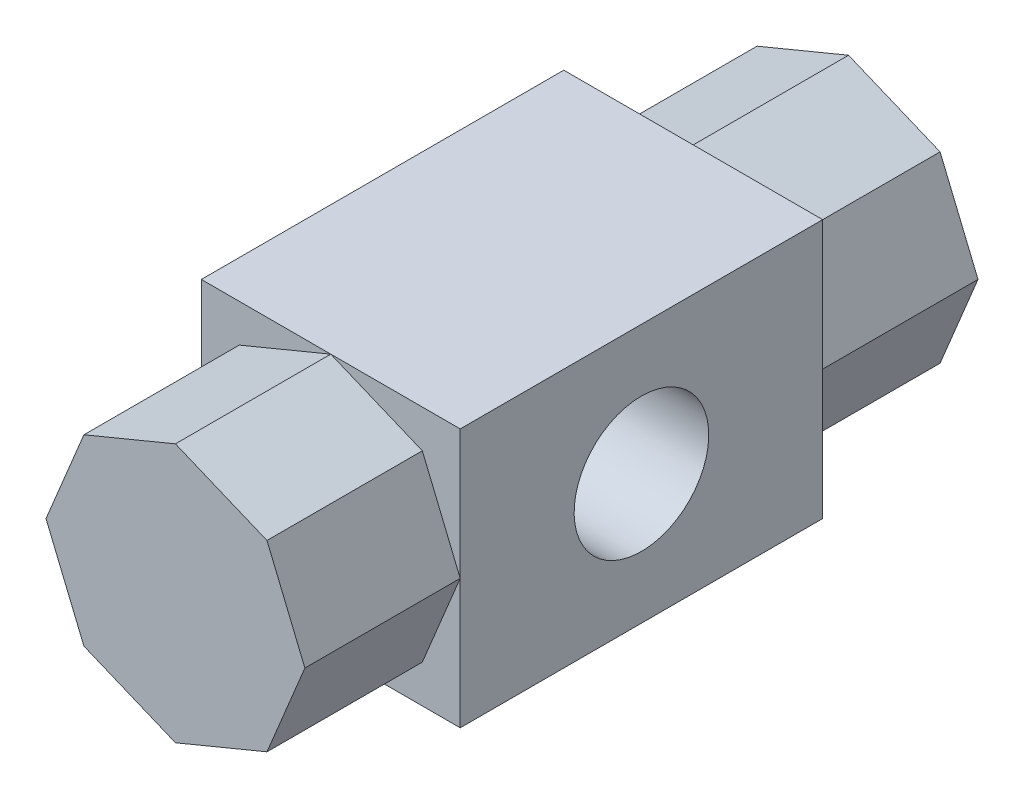
ISO-10303-21;
HEADER;
FILE_DESCRIPTION(('STEP AP214'),'2;1');
FILE_NAME('part.step','',(''),(''),'','','');
FILE_SCHEMA(('AUTOMOTIVE_DESIGN { 1 0 10303 214 1 1 1 1 }'));
ENDSEC;
DATA;
#1=APPLICATION_CONTEXT('core data for automotive mechanical design processes');
#2=APPLICATION_PROTOCOL_DEFINITION('international standard','automotive_design',2000,#1);
#3=PRODUCT_CONTEXT('',#1,'mechanical');
#4=PRODUCT('Part','Part','',(#3));
#5=PRODUCT_RELATED_PRODUCT_CATEGORY('part','',(#4));
#6=PRODUCT_DEFINITION_FORMATION('','',#4);
#7=PRODUCT_DEFINITION_CONTEXT('part definition',#1,'design');
#8=PRODUCT_DEFINITION('design','',#6,#7);
#9=PRODUCT_DEFINITION_SHAPE('','',#8);
#10=(LENGTH_UNIT() NAMED_UNIT(*) SI_UNIT(.MILLI.,.METRE.));
#11=(NAMED_UNIT(*) PLANE_ANGLE_UNIT() SI_UNIT($,.RADIAN.));
#12=(NAMED_UNIT(*) SI_UNIT($,.STERADIAN.) SOLID_ANGLE_UNIT());
#13=UNCERTAINTY_MEASURE_WITH_UNIT(LENGTH_MEASURE(1.E-05),#10,'distance_accuracy_value','');
#14=(GEOMETRIC_REPRESENTATION_CONTEXT(3) GLOBAL_UNCERTAINTY_ASSIGNED_CONTEXT((#13)) GLOBAL_UNIT_ASSIGNED_CONTEXT((#10,
#11,#12)) REPRESENTATION_CONTEXT('',''));
#15=CARTESIAN_POINT('',(0.,0.,0.));
#16=DIRECTION('',(0.,0.,1.));
#17=DIRECTION('',(1.,0.,0.));
#18=AXIS2_PLACEMENT_3D('',#15,#16,#17);
#19=CARTESIAN_POINT('',(17.6776695296639,-17.6776695296635,65.));
#20=DIRECTION('',(-0.923879532511291,0.382683432365079,0.));
#21=DIRECTION('',(-0.382683432365079,-0.923879532511291,0.));
#22=AXIS2_PLACEMENT_3D('',#19,#20,#21);
#23=PLANE('',#22);
#24=DIRECTION('',(0.,0.,-1.));
#25=VECTOR('',#24,1.);
#26=CARTESIAN_POINT('',(17.6776695296639,-17.6776695296635,65.));
#27=LINE('',#26,#25);
#28=CARTESIAN_POINT('',(17.6776695296639,-17.6776695296635,65.));
#29=VERTEX_POINT('',#28);
#30=CARTESIAN_POINT('',(17.6776695296639,-17.6776695296635,35.));
#31=VERTEX_POINT('',#30);
#32=EDGE_CURVE('E289',#29,#31,#27,.T.);
#33=ORIENTED_EDGE('',*,*,#32,.T.);
#34=DIRECTION('',(0.382683432365079,0.923879532511291,0.));
#35=VECTOR('',#34,1.);
#36=CARTESIAN_POINT('',(17.6776695296639,-17.6776695296635,35.));
#37=LINE('',#36,#35);
#38=CARTESIAN_POINT('',(25.,2.80132308624612E-13,35.));
#39=VERTEX_POINT('',#38);
#40=EDGE_CURVE('E244',#31,#39,#37,.T.);
#41=ORIENTED_EDGE('',*,*,#40,.T.);
#42=DIRECTION('',(0.,0.,-1.));
#43=VECTOR('',#42,1.);
#44=CARTESIAN_POINT('',(25.,2.08166817117217E-13,65.));
#45=LINE('',#44,#43);
#46=CARTESIAN_POINT('',(25.,2.08166817117217E-13,65.));
#47=VERTEX_POINT('',#46);
#48=EDGE_CURVE('E317',#47,#39,#45,.T.);
#49=ORIENTED_EDGE('',*,*,#48,.F.);
#50=DIRECTION('',(0.382683432365079,0.923879532511291,0.));
#51=VECTOR('',#50,1.);
#52=CARTESIAN_POINT('',(17.6776695296639,-17.6776695296635,65.));
#53=LINE('',#52,#51);
#54=EDGE_CURVE('E248',#29,#47,#53,.T.);
#55=ORIENTED_EDGE('',*,*,#54,.F.);
#56=EDGE_LOOP('',(#33,#41,#49,#55));
#57=FACE_BOUND('',#56,.T.);
#58=ADVANCED_FACE('F38',(#57),#23,.F.);
#59=CARTESIAN_POINT('',(25.,2.08166817117217E-13,65.));
#60=DIRECTION('',(-0.923879532511284,-0.382683432365097,0.));
#61=DIRECTION('',(0.382683432365098,-0.923879532511284,0.));
#62=AXIS2_PLACEMENT_3D('',#59,#60,#61);
#63=PLANE('',#62);
#64=ORIENTED_EDGE('',*,*,#48,.T.);
#65=DIRECTION('',(-0.382683432365098,0.923879532511284,0.));
#66=VECTOR('',#65,1.);
#67=CARTESIAN_POINT('',(25.,2.08166817117217E-13,35.));
#68=LINE('',#67,#66);
#69=CARTESIAN_POINT('',(17.6776695296635,17.6776695296638,35.));
#70=VERTEX_POINT('',#69);
#71=EDGE_CURVE('E182',#39,#70,#68,.T.);
#72=ORIENTED_EDGE('',*,*,#71,.T.);
#73=DIRECTION('',(0.,0.,-1.));
#74=VECTOR('',#73,1.);
#75=CARTESIAN_POINT('',(17.6776695296635,17.6776695296638,65.));
#76=LINE('',#75,#74);
#77=CARTESIAN_POINT('',(17.6776695296635,17.6776695296638,65.));
#78=VERTEX_POINT('',#77);
#79=EDGE_CURVE('E313',#78,#70,#76,.T.);
#80=ORIENTED_EDGE('',*,*,#79,.F.);
#81=DIRECTION('',(-0.382683432365097,0.923879532511284,0.));
#82=VECTOR('',#81,1.);
#83=CARTESIAN_POINT('',(25.,2.08166817117217E-13,65.));
#84=LINE('',#83,#82);
#85=EDGE_CURVE('E251',#47,#78,#84,.T.);
#86=ORIENTED_EDGE('',*,*,#85,.F.);
#87=EDGE_LOOP('',(#64,#72,#80,#86));
#88=FACE_BOUND('',#87,.T.);
#89=ADVANCED_FACE('F411',(#88),#63,.F.);
#90=CARTESIAN_POINT('',(17.6776695296635,17.6776695296638,65.));
#91=DIRECTION('',(-0.38268343236508,-0.923879532511291,0.));
#92=DIRECTION('',(0.923879532511291,-0.38268343236508,0.));
#93=AXIS2_PLACEMENT_3D('',#90,#91,#92);
#94=PLANE('',#93);
#95=ORIENTED_EDGE('',*,*,#79,.T.);
#96=DIRECTION('',(-0.923879532511291,0.38268343236508,0.));
#97=VECTOR('',#96,1.);
#98=CARTESIAN_POINT('',(17.6776695296635,17.6776695296638,35.));
#99=LINE('',#98,#97);
#100=CARTESIAN_POINT('',(-1.97756088141678E-13,25.,35.));
#101=VERTEX_POINT('',#100);
#102=EDGE_CURVE('E241',#70,#101,#99,.T.);
#103=ORIENTED_EDGE('',*,*,#102,.T.);
#104=DIRECTION('',(0.,0.,-1.));
#105=VECTOR('',#104,1.);
#106=CARTESIAN_POINT('',(-2.47981777371022E-13,25.,65.));
#107=LINE('',#106,#105);
#108=CARTESIAN_POINT('',(-2.47981777371022E-13,25.,65.));
#109=VERTEX_POINT('',#108);
#110=EDGE_CURVE('E309',#109,#101,#107,.T.);
#111=ORIENTED_EDGE('',*,*,#110,.F.);
#112=DIRECTION('',(-0.923879532511291,0.38268343236508,0.));
#113=VECTOR('',#112,1.);
#114=CARTESIAN_POINT('',(17.6776695296635,17.6776695296638,65.));
#115=LINE('',#114,#113);
#116=EDGE_CURVE('E254',#78,#109,#115,.T.);
#117=ORIENTED_EDGE('',*,*,#116,.F.);
#118=EDGE_LOOP('',(#95,#103,#111,#117));
#119=FACE_BOUND('',#118,.T.);
#120=ADVANCED_FACE('F416',(#119),#94,.F.);
#121=CARTESIAN_POINT('',(-2.47981777371022E-13,25.,65.));
#122=DIRECTION('',(0.382683432365099,-0.923879532511283,0.));
#123=DIRECTION('',(0.923879532511283,0.382683432365099,0.));
#124=AXIS2_PLACEMENT_3D('',#121,#122,#123);
#125=PLANE('',#124);
#126=ORIENTED_EDGE('',*,*,#110,.T.);
#127=DIRECTION('',(-0.923879532511283,-0.382683432365099,0.));
#128=VECTOR('',#127,1.);
#129=CARTESIAN_POINT('',(-2.47981777371022E-13,25.,35.));
#130=LINE('',#129,#128);
#131=CARTESIAN_POINT('',(-17.6776695296638,17.6776695296635,35.));
#132=VERTEX_POINT('',#131);
#133=EDGE_CURVE('E238',#101,#132,#130,.T.);
#134=ORIENTED_EDGE('',*,*,#133,.T.);
#135=DIRECTION('',(0.,0.,-1.));
#136=VECTOR('',#135,1.);
#137=CARTESIAN_POINT('',(-17.6776695296638,17.6776695296635,65.));
#138=LINE('',#137,#136);
#139=CARTESIAN_POINT('',(-17.6776695296638,17.6776695296635,65.));
#140=VERTEX_POINT('',#139);
#141=EDGE_CURVE('E305',#140,#132,#138,.T.);
#142=ORIENTED_EDGE('',*,*,#141,.F.);
#143=DIRECTION('',(-0.923879532511283,-0.382683432365099,0.));
#144=VECTOR('',#143,1.);
#145=CARTESIAN_POINT('',(-2.47981777371022E-13,25.,65.));
#146=LINE('',#145,#144);
#147=EDGE_CURVE('E256',#109,#140,#146,.T.);
#148=ORIENTED_EDGE('',*,*,#147,.F.);
#149=EDGE_LOOP('',(#126,#134,#142,#148));
#150=FACE_BOUND('',#149,.T.);
#151=ADVANCED_FACE('F443',(#150),#125,.F.);
#152=CARTESIAN_POINT('',(-17.6776695296638,17.6776695296635,65.));
#153=DIRECTION('',(0.92387953251129,-0.382683432365081,0.));
#154=DIRECTION('',(0.382683432365081,0.923879532511291,0.));
#155=AXIS2_PLACEMENT_3D('',#152,#153,#154);
#156=PLANE('',#155);
#157=ORIENTED_EDGE('',*,*,#141,.T.);
#158=DIRECTION('',(-0.382683432365081,-0.923879532511291,0.));
#159=VECTOR('',#158,1.);
#160=CARTESIAN_POINT('',(-17.6776695296638,17.6776695296635,35.));
#161=LINE('',#160,#159);
#162=CARTESIAN_POINT('',(-25.,-1.45354027718791E-13,35.));
#163=VERTEX_POINT('',#162);
#164=EDGE_CURVE('E235',#132,#163,#161,.T.);
#165=ORIENTED_EDGE('',*,*,#164,.T.);
#166=DIRECTION('',(0.,0.,-1.));
#167=VECTOR('',#166,1.);
#168=CARTESIAN_POINT('',(-25.,-2.51682997928799E-13,65.));
#169=LINE('',#168,#167);
#170=CARTESIAN_POINT('',(-25.,-2.51682997928799E-13,65.));
#171=VERTEX_POINT('',#170);
#172=EDGE_CURVE('E301',#171,#163,#169,.T.);
#173=ORIENTED_EDGE('',*,*,#172,.F.);
#174=DIRECTION('',(-0.382683432365081,-0.923879532511291,0.));
#175=VECTOR('',#174,1.);
#176=CARTESIAN_POINT('',(-17.6776695296638,17.6776695296635,65.));
#177=LINE('',#176,#175);
#178=EDGE_CURVE('E258',#140,#171,#177,.T.);
#179=ORIENTED_EDGE('',*,*,#178,.F.);
#180=EDGE_LOOP('',(#157,#165,#173,#179));
#181=FACE_BOUND('',#180,.T.);
#182=ADVANCED_FACE('F439',(#181),#156,.F.);
#183=CARTESIAN_POINT('',(-25.,-2.51682997928799E-13,65.));
#184=DIRECTION('',(0.923879532511283,0.382683432365099,0.));
#185=DIRECTION('',(-0.382683432365099,0.923879532511283,0.));
#186=AXIS2_PLACEMENT_3D('',#183,#184,#185);
#187=PLANE('',#186);
#188=ORIENTED_EDGE('',*,*,#172,.T.);
#189=DIRECTION('',(0.382683432365099,-0.923879532511283,0.));
#190=VECTOR('',#189,1.);
#191=CARTESIAN_POINT('',(-25.,-2.51682997928799E-13,35.));
#192=LINE('',#191,#190);
#193=CARTESIAN_POINT('',(-17.6776695296635,-17.6776695296639,35.));
#194=VERTEX_POINT('',#193);
#195=EDGE_CURVE('E232',#163,#194,#192,.T.);
#196=ORIENTED_EDGE('',*,*,#195,.T.);
#197=DIRECTION('',(0.,0.,-1.));
#198=VECTOR('',#197,1.);
#199=CARTESIAN_POINT('',(-17.6776695296635,-17.6776695296639,65.));
#200=LINE('',#199,#198);
#201=CARTESIAN_POINT('',(-17.6776695296635,-17.6776695296639,65.));
#202=VERTEX_POINT('',#201);
#203=EDGE_CURVE('E297',#202,#194,#200,.T.);
#204=ORIENTED_EDGE('',*,*,#203,.F.);
#205=DIRECTION('',(0.382683432365099,-0.923879532511283,0.));
#206=VECTOR('',#205,1.);
#207=CARTESIAN_POINT('',(-25.,-2.51682997928799E-13,65.));
#208=LINE('',#207,#206);
#209=EDGE_CURVE('E260',#171,#202,#208,.T.);
#210=ORIENTED_EDGE('',*,*,#209,.F.);
#211=EDGE_LOOP('',(#188,#196,#204,#210));
#212=FACE_BOUND('',#211,.T.);
#213=ADVANCED_FACE('F435',(#212),#187,.F.);
#214=CARTESIAN_POINT('',(-17.6776695296635,-17.6776695296639,65.));
#215=DIRECTION('',(0.382683432365082,0.92387953251129,0.));
#216=DIRECTION('',(-0.92387953251129,0.382683432365082,0.));
#217=AXIS2_PLACEMENT_3D('',#214,#215,#216);
#218=PLANE('',#217);
#219=ORIENTED_EDGE('',*,*,#203,.T.);
#220=DIRECTION('',(0.92387953251129,-0.382683432365082,0.));
#221=VECTOR('',#220,1.);
#222=CARTESIAN_POINT('',(-17.6776695296635,-17.6776695296639,35.));
#223=LINE('',#222,#221);
#224=CARTESIAN_POINT('',(2.6068193945565E-13,-25.,35.));
#225=VERTEX_POINT('',#224);
#226=EDGE_CURVE('E229',#194,#225,#223,.T.);
#227=ORIENTED_EDGE('',*,*,#226,.T.);
#228=DIRECTION('',(0.,0.,-1.));
#229=VECTOR('',#228,1.);
#230=CARTESIAN_POINT('',(2.60330291914301E-13,-25.,65.));
#231=LINE('',#230,#229);
#232=CARTESIAN_POINT('',(2.60330291914301E-13,-25.,65.));
#233=VERTEX_POINT('',#232);
#234=EDGE_CURVE('E293',#233,#225,#231,.T.);
#235=ORIENTED_EDGE('',*,*,#234,.F.);
#236=DIRECTION('',(0.92387953251129,-0.382683432365082,0.));
#237=VECTOR('',#236,1.);
#238=CARTESIAN_POINT('',(-17.6776695296635,-17.6776695296639,65.));
#239=LINE('',#238,#237);
#240=EDGE_CURVE('E262',#202,#233,#239,.T.);
#241=ORIENTED_EDGE('',*,*,#240,.F.);
#242=EDGE_LOOP('',(#219,#227,#235,#241));
#243=FACE_BOUND('',#242,.T.);
#244=ADVANCED_FACE('F430',(#243),#218,.F.);
#245=CARTESIAN_POINT('',(2.60330291914301E-13,-25.,65.));
#246=DIRECTION('',(-0.3826834323651,0.923879532511282,0.));
#247=DIRECTION('',(-0.923879532511283,-0.3826834323651,0.));
#248=AXIS2_PLACEMENT_3D('',#245,#246,#247);
#249=PLANE('',#248);
#250=ORIENTED_EDGE('',*,*,#234,.T.);
#251=DIRECTION('',(0.923879532511283,0.3826834323651,0.));
#252=VECTOR('',#251,1.);
#253=CARTESIAN_POINT('',(2.60330291914301E-13,-25.,35.));
#254=LINE('',#253,#252);
#255=EDGE_CURVE('E11',#225,#31,#254,.T.);
#256=ORIENTED_EDGE('',*,*,#255,.T.);
#257=ORIENTED_EDGE('',*,*,#32,.F.);
#258=DIRECTION('',(0.923879532511283,0.3826834323651,0.));
#259=VECTOR('',#258,1.);
#260=CARTESIAN_POINT('',(2.60330291914301E-13,-25.,65.));
#261=LINE('',#260,#259);
#262=EDGE_CURVE('E264',#233,#29,#261,.T.);
#263=ORIENTED_EDGE('',*,*,#262,.F.);
#264=EDGE_LOOP('',(#250,#256,#257,#263));
#265=FACE_BOUND('',#264,.T.);
#266=ADVANCED_FACE('F423',(#265),#249,.F.);
#267=CARTESIAN_POINT('',(0.,0.,65.));
#268=DIRECTION('',(0.,0.,1.));
#269=DIRECTION('',(1.,0.,0.));
#270=AXIS2_PLACEMENT_3D('',#267,#268,#269);
#271=PLANE('',#270);
#272=ORIENTED_EDGE('',*,*,#54,.T.);
#273=ORIENTED_EDGE('',*,*,#85,.T.);
#274=ORIENTED_EDGE('',*,*,#116,.T.);
#275=ORIENTED_EDGE('',*,*,#147,.T.);
#276=ORIENTED_EDGE('',*,*,#178,.T.);
#277=ORIENTED_EDGE('',*,*,#209,.T.);
#278=ORIENTED_EDGE('',*,*,#240,.T.);
#279=ORIENTED_EDGE('',*,*,#262,.T.);
#280=EDGE_LOOP('',(#272,#273,#274,#275,#276,#277,#278,#279));
#281=FACE_BOUND('',#280,.T.);
#282=ADVANCED_FACE('F450',(#281),#271,.T.);
#283=CARTESIAN_POINT('',(25.,25.,35.));
#284=DIRECTION('',(-1.,0.,0.));
#285=DIRECTION('',(0.,-1.,0.));
#286=AXIS2_PLACEMENT_3D('',#283,#284,#285);
#287=PLANE('',#286);
#288=CARTESIAN_POINT('',(25.,0.,0.));
#289=DIRECTION('',(1.,0.,0.));
#290=DIRECTION('',(0.,1.,0.));
#291=AXIS2_PLACEMENT_3D('',#288,#289,#290);
#292=CIRCLE('',#291,13.);
#293=CARTESIAN_POINT('',(25.,13.,0.));
#294=VERTEX_POINT('',#293);
#295=EDGE_CURVE('E392',#294,#294,#292,.T.);
#296=ORIENTED_EDGE('',*,*,#295,.F.);
#297=EDGE_LOOP('',(#296));
#298=FACE_BOUND('',#297,.T.);
#299=DIRECTION('',(0.,1.,0.));
#300=VECTOR('',#299,1.);
#301=CARTESIAN_POINT('',(25.,25.,35.));
#302=LINE('',#301,#300);
#303=CARTESIAN_POINT('',(25.,25.,35.));
#304=VERTEX_POINT('',#303);
#305=EDGE_CURVE('E176',#39,#304,#302,.T.);
#306=ORIENTED_EDGE('',*,*,#305,.F.);
#307=CARTESIAN_POINT('',(25.,-25.,35.));
#308=VERTEX_POINT('',#307);
#309=EDGE_CURVE('E187',#308,#39,#302,.T.);
#310=ORIENTED_EDGE('',*,*,#309,.F.);
#311=DIRECTION('',(0.,0.,-1.));
#312=VECTOR('',#311,1.);
#313=CARTESIAN_POINT('',(25.,-25.,35.));
#314=LINE('',#313,#312);
#315=CARTESIAN_POINT('',(25.,-25.,-35.));
#316=VERTEX_POINT('',#315);
#317=EDGE_CURVE('E368',#308,#316,#314,.T.);
#318=ORIENTED_EDGE('',*,*,#317,.T.);
#319=DIRECTION('',(0.,1.,0.));
#320=VECTOR('',#319,1.);
#321=CARTESIAN_POINT('',(25.,25.,-35.));
#322=LINE('',#321,#320);
#323=CARTESIAN_POINT('',(25.,2.08166817117217E-13,-35.));
#324=VERTEX_POINT('',#323);
#325=EDGE_CURVE('E364',#316,#324,#322,.T.);
#326=ORIENTED_EDGE('',*,*,#325,.T.);
#327=CARTESIAN_POINT('',(25.,25.,-35.));
#328=VERTEX_POINT('',#327);
#329=EDGE_CURVE('E203',#324,#328,#322,.T.);
#330=ORIENTED_EDGE('',*,*,#329,.T.);
#331=DIRECTION('',(0.,0.,-1.));
#332=VECTOR('',#331,1.);
#333=CARTESIAN_POINT('',(25.,25.,35.));
#334=LINE('',#333,#332);
#335=EDGE_CURVE('E195',#304,#328,#334,.T.);
#336=ORIENTED_EDGE('',*,*,#335,.F.);
#337=EDGE_LOOP('',(#306,#310,#318,#326,#330,#336));
#338=FACE_BOUND('',#337,.T.);
#339=ADVANCED_FACE('F200',(#298,#338),#287,.F.);
#340=CARTESIAN_POINT('',(-25.,25.,35.));
#341=DIRECTION('',(0.,-1.,0.));
#342=DIRECTION('',(0.,0.,-1.));
#343=AXIS2_PLACEMENT_3D('',#340,#341,#342);
#344=PLANE('',#343);
#345=DIRECTION('',(-1.,0.,0.));
#346=VECTOR('',#345,1.);
#347=CARTESIAN_POINT('',(-25.,25.,35.));
#348=LINE('',#347,#346);
#349=CARTESIAN_POINT('',(-25.,25.,35.));
#350=VERTEX_POINT('',#349);
#351=EDGE_CURVE('E197',#101,#350,#348,.T.);
#352=ORIENTED_EDGE('',*,*,#351,.F.);
#353=EDGE_CURVE('E179',#304,#101,#348,.T.);
#354=ORIENTED_EDGE('',*,*,#353,.F.);
#355=ORIENTED_EDGE('',*,*,#335,.T.);
#356=DIRECTION('',(-1.,0.,0.));
#357=VECTOR('',#356,1.);
#358=CARTESIAN_POINT('',(-25.,25.,-35.));
#359=LINE('',#358,#357);
#360=CARTESIAN_POINT('',(-2.47981777371022E-13,25.,-35.));
#361=VERTEX_POINT('',#360);
#362=EDGE_CURVE('E363',#328,#361,#359,.T.);
#363=ORIENTED_EDGE('',*,*,#362,.T.);
#364=CARTESIAN_POINT('',(-25.,25.,-35.));
#365=VERTEX_POINT('',#364);
#366=EDGE_CURVE('E355',#361,#365,#359,.T.);
#367=ORIENTED_EDGE('',*,*,#366,.T.);
#368=DIRECTION('',(0.,0.,-1.));
#369=VECTOR('',#368,1.);
#370=CARTESIAN_POINT('',(-25.,25.,35.));
#371=LINE('',#370,#369);
#372=EDGE_CURVE('E206',#350,#365,#371,.T.);
#373=ORIENTED_EDGE('',*,*,#372,.F.);
#374=EDGE_LOOP('',(#352,#354,#355,#363,#367,#373));
#375=FACE_BOUND('',#374,.T.);
#376=ADVANCED_FACE('F193',(#375),#344,.F.);
#377=CARTESIAN_POINT('',(-25.,25.,35.));
#378=DIRECTION('',(1.,0.,0.));
#379=DIRECTION('',(0.,1.,0.));
#380=AXIS2_PLACEMENT_3D('',#377,#378,#379);
#381=PLANE('',#380);
#382=CARTESIAN_POINT('',(-25.,0.,0.));
#383=DIRECTION('',(1.,0.,0.));
#384=DIRECTION('',(0.,1.,0.));
#385=AXIS2_PLACEMENT_3D('',#382,#383,#384);
#386=CIRCLE('',#385,13.);
#387=CARTESIAN_POINT('',(-25.,13.,0.));
#388=VERTEX_POINT('',#387);
#389=EDGE_CURVE('E41',#388,#388,#386,.T.);
#390=ORIENTED_EDGE('',*,*,#389,.T.);
#391=EDGE_LOOP('',(#390));
#392=FACE_BOUND('',#391,.T.);
#393=DIRECTION('',(0.,-1.,0.));
#394=VECTOR('',#393,1.);
#395=CARTESIAN_POINT('',(-25.,25.,35.));
#396=LINE('',#395,#394);
#397=CARTESIAN_POINT('',(-25.,-25.,35.));
#398=VERTEX_POINT('',#397);
#399=EDGE_CURVE('E198',#163,#398,#396,.T.);
#400=ORIENTED_EDGE('',*,*,#399,.F.);
#401=EDGE_CURVE('E388',#350,#163,#396,.T.);
#402=ORIENTED_EDGE('',*,*,#401,.F.);
#403=ORIENTED_EDGE('',*,*,#372,.T.);
#404=DIRECTION('',(0.,-1.,0.));
#405=VECTOR('',#404,1.);
#406=CARTESIAN_POINT('',(-25.,25.,-35.));
#407=LINE('',#406,#405);
#408=CARTESIAN_POINT('',(-25.,-2.51682997928799E-13,-35.));
#409=VERTEX_POINT('',#408);
#410=EDGE_CURVE('E354',#365,#409,#407,.T.);
#411=ORIENTED_EDGE('',*,*,#410,.T.);
#412=CARTESIAN_POINT('',(-25.,-25.,-35.));
#413=VERTEX_POINT('',#412);
#414=EDGE_CURVE('E340',#409,#413,#407,.T.);
#415=ORIENTED_EDGE('',*,*,#414,.T.);
#416=DIRECTION('',(0.,0.,-1.));
#417=VECTOR('',#416,1.);
#418=CARTESIAN_POINT('',(-25.,-25.,35.));
#419=LINE('',#418,#417);
#420=EDGE_CURVE('E212',#398,#413,#419,.T.);
#421=ORIENTED_EDGE('',*,*,#420,.F.);
#422=EDGE_LOOP('',(#400,#402,#403,#411,#415,#421));
#423=FACE_BOUND('',#422,.T.);
#424=ADVANCED_FACE('F385',(#392,#423),#381,.F.);
#425=CARTESIAN_POINT('',(-25.,-25.,35.));
#426=DIRECTION('',(0.,1.,0.));
#427=DIRECTION('',(0.,0.,1.));
#428=AXIS2_PLACEMENT_3D('',#425,#426,#427);
#429=PLANE('',#428);
#430=DIRECTION('',(1.,0.,0.));
#431=VECTOR('',#430,1.);
#432=CARTESIAN_POINT('',(-25.,-25.,35.));
#433=LINE('',#432,#431);
#434=EDGE_CURVE('E390',#225,#308,#433,.T.);
#435=ORIENTED_EDGE('',*,*,#434,.F.);
#436=EDGE_CURVE('E371',#398,#225,#433,.T.);
#437=ORIENTED_EDGE('',*,*,#436,.F.);
#438=ORIENTED_EDGE('',*,*,#420,.T.);
#439=DIRECTION('',(1.,0.,0.));
#440=VECTOR('',#439,1.);
#441=CARTESIAN_POINT('',(-25.,-25.,-35.));
#442=LINE('',#441,#440);
#443=CARTESIAN_POINT('',(2.60330291914301E-13,-25.,-35.));
#444=VERTEX_POINT('',#443);
#445=EDGE_CURVE('E188',#413,#444,#442,.T.);
#446=ORIENTED_EDGE('',*,*,#445,.T.);
#447=EDGE_CURVE('E326',#444,#316,#442,.T.);
#448=ORIENTED_EDGE('',*,*,#447,.T.);
#449=ORIENTED_EDGE('',*,*,#317,.F.);
#450=EDGE_LOOP('',(#435,#437,#438,#446,#448,#449));
#451=FACE_BOUND('',#450,.T.);
#452=ADVANCED_FACE('F381',(#451),#429,.F.);
#453=CARTESIAN_POINT('',(0.,0.,35.));
#454=DIRECTION('',(0.,0.,1.));
#455=DIRECTION('',(1.,0.,0.));
#456=AXIS2_PLACEMENT_3D('',#453,#454,#455);
#457=PLANE('',#456);
#458=ORIENTED_EDGE('',*,*,#40,.F.);
#459=ORIENTED_EDGE('',*,*,#255,.F.);
#460=ORIENTED_EDGE('',*,*,#434,.T.);
#461=ORIENTED_EDGE('',*,*,#309,.T.);
#462=EDGE_LOOP('',(#458,#459,#460,#461));
#463=FACE_BOUND('',#462,.T.);
#464=ADVANCED_FACE('F426',(#463),#457,.T.);
#465=ORIENTED_EDGE('',*,*,#71,.F.);
#466=ORIENTED_EDGE('',*,*,#305,.T.);
#467=ORIENTED_EDGE('',*,*,#353,.T.);
#468=ORIENTED_EDGE('',*,*,#102,.F.);
#469=EDGE_LOOP('',(#465,#466,#467,#468));
#470=FACE_BOUND('',#469,.T.);
#471=ADVANCED_FACE('F178',(#470),#457,.T.);
#472=ORIENTED_EDGE('',*,*,#133,.F.);
#473=ORIENTED_EDGE('',*,*,#351,.T.);
#474=ORIENTED_EDGE('',*,*,#401,.T.);
#475=ORIENTED_EDGE('',*,*,#164,.F.);
#476=EDGE_LOOP('',(#472,#473,#474,#475));
#477=FACE_BOUND('',#476,.T.);
#478=ADVANCED_FACE('F441',(#477),#457,.T.);
#479=ORIENTED_EDGE('',*,*,#195,.F.);
#480=ORIENTED_EDGE('',*,*,#399,.T.);
#481=ORIENTED_EDGE('',*,*,#436,.T.);
#482=ORIENTED_EDGE('',*,*,#226,.F.);
#483=EDGE_LOOP('',(#479,#480,#481,#482));
#484=FACE_BOUND('',#483,.T.);
#485=ADVANCED_FACE('F428',(#484),#457,.T.);
#486=CARTESIAN_POINT('',(0.,0.,-35.));
#487=DIRECTION('',(0.,0.,1.));
#488=DIRECTION('',(1.,0.,0.));
#489=AXIS2_PLACEMENT_3D('',#486,#487,#488);
#490=PLANE('',#489);
#491=DIRECTION('',(0.923879532511283,0.3826834323651,0.));
#492=VECTOR('',#491,1.);
#493=CARTESIAN_POINT('',(2.60330291914301E-13,-25.,-35.));
#494=LINE('',#493,#492);
#495=CARTESIAN_POINT('',(17.6776695296639,-17.6776695296635,-35.));
#496=VERTEX_POINT('',#495);
#497=EDGE_CURVE('E46',#444,#496,#494,.T.);
#498=ORIENTED_EDGE('',*,*,#497,.T.);
#499=DIRECTION('',(0.382683432365079,0.923879532511291,0.));
#500=VECTOR('',#499,1.);
#501=CARTESIAN_POINT('',(17.6776695296639,-17.6776695296635,-35.));
#502=LINE('',#501,#500);
#503=EDGE_CURVE('E226',#496,#324,#502,.T.);
#504=ORIENTED_EDGE('',*,*,#503,.T.);
#505=ORIENTED_EDGE('',*,*,#325,.F.);
#506=ORIENTED_EDGE('',*,*,#447,.F.);
#507=EDGE_LOOP('',(#498,#504,#505,#506));
#508=FACE_BOUND('',#507,.T.);
#509=ADVANCED_FACE('F323',(#508),#490,.F.);
#510=ORIENTED_EDGE('',*,*,#329,.F.);
#511=DIRECTION('',(-0.382683432365098,0.923879532511284,0.));
#512=VECTOR('',#511,1.);
#513=CARTESIAN_POINT('',(25.,2.08166817117217E-13,-35.));
#514=LINE('',#513,#512);
#515=CARTESIAN_POINT('',(17.6776695296635,17.6776695296638,-35.));
#516=VERTEX_POINT('',#515);
#517=EDGE_CURVE('E53',#324,#516,#514,.T.);
#518=ORIENTED_EDGE('',*,*,#517,.T.);
#519=DIRECTION('',(-0.923879532511291,0.38268343236508,0.));
#520=VECTOR('',#519,1.);
#521=CARTESIAN_POINT('',(17.6776695296635,17.6776695296638,-35.));
#522=LINE('',#521,#520);
#523=EDGE_CURVE('E61',#516,#361,#522,.T.);
#524=ORIENTED_EDGE('',*,*,#523,.T.);
#525=ORIENTED_EDGE('',*,*,#362,.F.);
#526=EDGE_LOOP('',(#510,#518,#524,#525));
#527=FACE_BOUND('',#526,.T.);
#528=ADVANCED_FACE('F362',(#527),#490,.F.);
#529=ORIENTED_EDGE('',*,*,#366,.F.);
#530=DIRECTION('',(-0.923879532511283,-0.382683432365099,0.));
#531=VECTOR('',#530,1.);
#532=CARTESIAN_POINT('',(-2.47981777371022E-13,25.,-35.));
#533=LINE('',#532,#531);
#534=CARTESIAN_POINT('',(-17.6776695296638,17.6776695296635,-35.));
#535=VERTEX_POINT('',#534);
#536=EDGE_CURVE('E221',#361,#535,#533,.T.);
#537=ORIENTED_EDGE('',*,*,#536,.T.);
#538=DIRECTION('',(-0.382683432365081,-0.923879532511291,0.));
#539=VECTOR('',#538,1.);
#540=CARTESIAN_POINT('',(-17.6776695296638,17.6776695296635,-35.));
#541=LINE('',#540,#539);
#542=EDGE_CURVE('E218',#535,#409,#541,.T.);
#543=ORIENTED_EDGE('',*,*,#542,.T.);
#544=ORIENTED_EDGE('',*,*,#410,.F.);
#545=EDGE_LOOP('',(#529,#537,#543,#544));
#546=FACE_BOUND('',#545,.T.);
#547=ADVANCED_FACE('F353',(#546),#490,.F.);
#548=ORIENTED_EDGE('',*,*,#414,.F.);
#549=DIRECTION('',(0.382683432365099,-0.923879532511283,0.));
#550=VECTOR('',#549,1.);
#551=CARTESIAN_POINT('',(-25.,-2.51682997928799E-13,-35.));
#552=LINE('',#551,#550);
#553=CARTESIAN_POINT('',(-17.6776695296635,-17.6776695296639,-35.));
#554=VERTEX_POINT('',#553);
#555=EDGE_CURVE('E209',#409,#554,#552,.T.);
#556=ORIENTED_EDGE('',*,*,#555,.T.);
#557=DIRECTION('',(0.92387953251129,-0.382683432365082,0.));
#558=VECTOR('',#557,1.);
#559=CARTESIAN_POINT('',(-17.6776695296635,-17.6776695296639,-35.));
#560=LINE('',#559,#558);
#561=EDGE_CURVE('E205',#554,#444,#560,.T.);
#562=ORIENTED_EDGE('',*,*,#561,.T.);
#563=ORIENTED_EDGE('',*,*,#445,.F.);
#564=EDGE_LOOP('',(#548,#556,#562,#563));
#565=FACE_BOUND('',#564,.T.);
#566=ADVANCED_FACE('F339',(#565),#490,.F.);
#567=CARTESIAN_POINT('',(0.,0.,-65.));
#568=DIRECTION('',(0.,0.,1.));
#569=DIRECTION('',(1.,0.,0.));
#570=AXIS2_PLACEMENT_3D('',#567,#568,#569);
#571=PLANE('',#570);
#572=DIRECTION('',(0.382683432365079,0.923879532511291,0.));
#573=VECTOR('',#572,1.);
#574=CARTESIAN_POINT('',(17.6776695296639,-17.6776695296635,-65.));
#575=LINE('',#574,#573);
#576=CARTESIAN_POINT('',(17.6776695296639,-17.6776695296635,-65.));
#577=VERTEX_POINT('',#576);
#578=CARTESIAN_POINT('',(25.,2.08166817117217E-13,-65.));
#579=VERTEX_POINT('',#578);
#580=EDGE_CURVE('E247',#577,#579,#575,.T.);
#581=ORIENTED_EDGE('',*,*,#580,.F.);
#582=DIRECTION('',(0.923879532511283,0.3826834323651,0.));
#583=VECTOR('',#582,1.);
#584=CARTESIAN_POINT('',(2.60330291914301E-13,-25.,-65.));
#585=LINE('',#584,#583);
#586=CARTESIAN_POINT('',(2.60330291914301E-13,-25.,-65.));
#587=VERTEX_POINT('',#586);
#588=EDGE_CURVE('E252',#587,#577,#585,.T.);
#589=ORIENTED_EDGE('',*,*,#588,.F.);
#590=DIRECTION('',(0.92387953251129,-0.382683432365082,0.));
#591=VECTOR('',#590,1.);
#592=CARTESIAN_POINT('',(-17.6776695296635,-17.6776695296639,-65.));
#593=LINE('',#592,#591);
#594=CARTESIAN_POINT('',(-17.6776695296635,-17.6776695296639,-65.));
#595=VERTEX_POINT('',#594);
#596=EDGE_CURVE('E284',#595,#587,#593,.T.);
#597=ORIENTED_EDGE('',*,*,#596,.F.);
#598=DIRECTION('',(0.382683432365099,-0.923879532511283,0.));
#599=VECTOR('',#598,1.);
#600=CARTESIAN_POINT('',(-25.,-2.51682997928799E-13,-65.));
#601=LINE('',#600,#599);
#602=CARTESIAN_POINT('',(-25.,-2.51682997928799E-13,-65.));
#603=VERTEX_POINT('',#602);
#604=EDGE_CURVE('E281',#603,#595,#601,.T.);
#605=ORIENTED_EDGE('',*,*,#604,.F.);
#606=DIRECTION('',(-0.382683432365081,-0.923879532511291,0.));
#607=VECTOR('',#606,1.);
#608=CARTESIAN_POINT('',(-17.6776695296638,17.6776695296635,-65.));
#609=LINE('',#608,#607);
#610=CARTESIAN_POINT('',(-17.6776695296638,17.6776695296635,-65.));
#611=VERTEX_POINT('',#610);
#612=EDGE_CURVE('E278',#611,#603,#609,.T.);
#613=ORIENTED_EDGE('',*,*,#612,.F.);
#614=DIRECTION('',(-0.923879532511283,-0.382683432365099,0.));
#615=VECTOR('',#614,1.);
#616=CARTESIAN_POINT('',(-2.47981777371022E-13,25.,-65.));
#617=LINE('',#616,#615);
#618=CARTESIAN_POINT('',(-2.47981777371022E-13,25.,-65.));
#619=VERTEX_POINT('',#618);
#620=EDGE_CURVE('E275',#619,#611,#617,.T.);
#621=ORIENTED_EDGE('',*,*,#620,.F.);
#622=DIRECTION('',(-0.923879532511291,0.38268343236508,0.));
#623=VECTOR('',#622,1.);
#624=CARTESIAN_POINT('',(17.6776695296635,17.6776695296638,-65.));
#625=LINE('',#624,#623);
#626=CARTESIAN_POINT('',(17.6776695296635,17.6776695296638,-65.));
#627=VERTEX_POINT('',#626);
#628=EDGE_CURVE('E272',#627,#619,#625,.T.);
#629=ORIENTED_EDGE('',*,*,#628,.F.);
#630=DIRECTION('',(-0.382683432365097,0.923879532511284,0.));
#631=VECTOR('',#630,1.);
#632=CARTESIAN_POINT('',(25.,2.08166817117217E-13,-65.));
#633=LINE('',#632,#631);
#634=EDGE_CURVE('E269',#579,#627,#633,.T.);
#635=ORIENTED_EDGE('',*,*,#634,.F.);
#636=EDGE_LOOP('',(#581,#589,#597,#605,#613,#621,#629,#635));
#637=FACE_BOUND('',#636,.T.);
#638=ADVANCED_FACE('F462',(#637),#571,.F.);
#639=ORIENTED_EDGE('',*,*,#497,.F.);
#640=EDGE_CURVE('E292',#444,#587,#231,.T.);
#641=ORIENTED_EDGE('',*,*,#640,.T.);
#642=ORIENTED_EDGE('',*,*,#588,.T.);
#643=EDGE_CURVE('E266',#496,#577,#27,.T.);
#644=ORIENTED_EDGE('',*,*,#643,.F.);
#645=EDGE_LOOP('',(#639,#641,#642,#644));
#646=FACE_BOUND('',#645,.T.);
#647=ADVANCED_FACE('F330',(#646),#249,.F.);
#648=ORIENTED_EDGE('',*,*,#561,.F.);
#649=EDGE_CURVE('E296',#554,#595,#200,.T.);
#650=ORIENTED_EDGE('',*,*,#649,.T.);
#651=ORIENTED_EDGE('',*,*,#596,.T.);
#652=ORIENTED_EDGE('',*,*,#640,.F.);
#653=EDGE_LOOP('',(#648,#650,#651,#652));
#654=FACE_BOUND('',#653,.T.);
#655=ADVANCED_FACE('F332',(#654),#218,.F.);
#656=ORIENTED_EDGE('',*,*,#555,.F.);
#657=EDGE_CURVE('E300',#409,#603,#169,.T.);
#658=ORIENTED_EDGE('',*,*,#657,.T.);
#659=ORIENTED_EDGE('',*,*,#604,.T.);
#660=ORIENTED_EDGE('',*,*,#649,.F.);
#661=EDGE_LOOP('',(#656,#658,#659,#660));
#662=FACE_BOUND('',#661,.T.);
#663=ADVANCED_FACE('F344',(#662),#187,.F.);
#664=ORIENTED_EDGE('',*,*,#542,.F.);
#665=EDGE_CURVE('E304',#535,#611,#138,.T.);
#666=ORIENTED_EDGE('',*,*,#665,.T.);
#667=ORIENTED_EDGE('',*,*,#612,.T.);
#668=ORIENTED_EDGE('',*,*,#657,.F.);
#669=EDGE_LOOP('',(#664,#666,#667,#668));
#670=FACE_BOUND('',#669,.T.);
#671=ADVANCED_FACE('F346',(#670),#156,.F.);
#672=ORIENTED_EDGE('',*,*,#536,.F.);
#673=EDGE_CURVE('E308',#361,#619,#107,.T.);
#674=ORIENTED_EDGE('',*,*,#673,.T.);
#675=ORIENTED_EDGE('',*,*,#620,.T.);
#676=ORIENTED_EDGE('',*,*,#665,.F.);
#677=EDGE_LOOP('',(#672,#674,#675,#676));
#678=FACE_BOUND('',#677,.T.);
#679=ADVANCED_FACE('F357',(#678),#125,.F.);
#680=ORIENTED_EDGE('',*,*,#523,.F.);
#681=EDGE_CURVE('E312',#516,#627,#76,.T.);
#682=ORIENTED_EDGE('',*,*,#681,.T.);
#683=ORIENTED_EDGE('',*,*,#628,.T.);
#684=ORIENTED_EDGE('',*,*,#673,.F.);
#685=EDGE_LOOP('',(#680,#682,#683,#684));
#686=FACE_BOUND('',#685,.T.);
#687=ADVANCED_FACE('F358',(#686),#94,.F.);
#688=ORIENTED_EDGE('',*,*,#517,.F.);
#689=EDGE_CURVE('E316',#324,#579,#45,.T.);
#690=ORIENTED_EDGE('',*,*,#689,.T.);
#691=ORIENTED_EDGE('',*,*,#634,.T.);
#692=ORIENTED_EDGE('',*,*,#681,.F.);
#693=EDGE_LOOP('',(#688,#690,#691,#692));
#694=FACE_BOUND('',#693,.T.);
#695=ADVANCED_FACE('F407',(#694),#63,.F.);
#696=ORIENTED_EDGE('',*,*,#503,.F.);
#697=ORIENTED_EDGE('',*,*,#643,.T.);
#698=ORIENTED_EDGE('',*,*,#580,.T.);
#699=ORIENTED_EDGE('',*,*,#689,.F.);
#700=EDGE_LOOP('',(#696,#697,#698,#699));
#701=FACE_BOUND('',#700,.T.);
#702=ADVANCED_FACE('F402',(#701),#23,.F.);
#703=CARTESIAN_POINT('',(-45.,0.,0.));
#704=DIRECTION('',(1.,0.,0.));
#705=DIRECTION('',(0.,1.,0.));
#706=AXIS2_PLACEMENT_3D('',#703,#704,#705);
#707=CYLINDRICAL_SURFACE('',#706,13.);
#708=ORIENTED_EDGE('',*,*,#295,.T.);
#709=EDGE_LOOP('',(#708));
#710=FACE_BOUND('',#709,.T.);
#711=ORIENTED_EDGE('',*,*,#389,.F.);
#712=EDGE_LOOP('',(#711));
#713=FACE_BOUND('',#712,.T.);
#714=ADVANCED_FACE('F400',(#710,#713),#707,.F.);
#715=CLOSED_SHELL('',(#58,#89,#120,#151,#182,#213,#244,#266,#282,#339,#376,#424,#452,#464,#471,
#478,#485,#509,#528,#547,#566,#638,#647,#655,#663,#671,#679,#687,#695,#702,#714));
#716=MANIFOLD_SOLID_BREP('B2',#715);
#717=ADVANCED_BREP_SHAPE_REPRESENTATION('',(#18,#716),#14);
#718=SHAPE_DEFINITION_REPRESENTATION(#9,#717);
ENDSEC;
END-ISO-10303-21;
